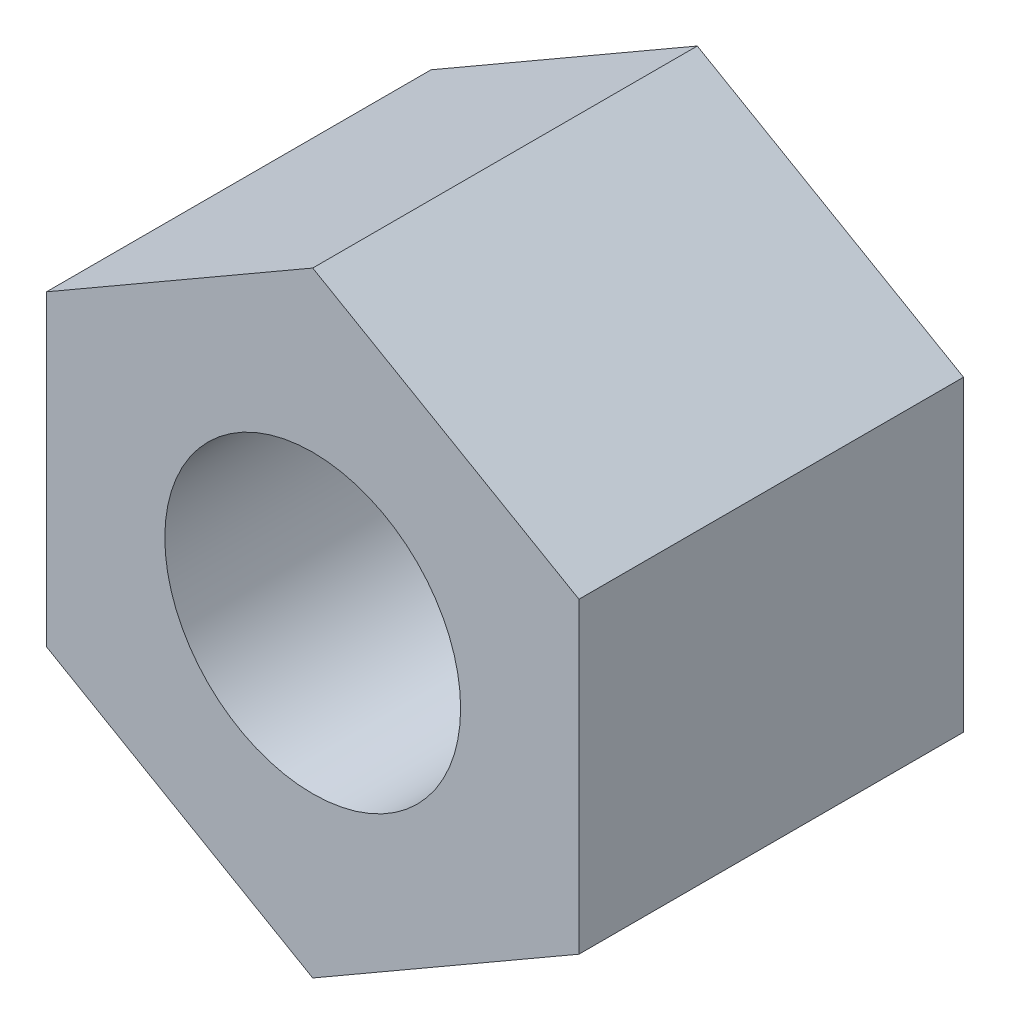
ISO-10303-21;
HEADER;
FILE_DESCRIPTION(('STEP AP214'),'2;1');
FILE_NAME('part.step','',(''),(''),'','','');
FILE_SCHEMA(('AUTOMOTIVE_DESIGN { 1 0 10303 214 1 1 1 1 }'));
ENDSEC;
DATA;
#1=APPLICATION_CONTEXT('core data for automotive mechanical design processes');
#2=APPLICATION_PROTOCOL_DEFINITION('international standard','automotive_design',2000,#1);
#3=PRODUCT_CONTEXT('',#1,'mechanical');
#4=PRODUCT('Part','Part','',(#3));
#5=PRODUCT_RELATED_PRODUCT_CATEGORY('part','',(#4));
#6=PRODUCT_DEFINITION_FORMATION('','',#4);
#7=PRODUCT_DEFINITION_CONTEXT('part definition',#1,'design');
#8=PRODUCT_DEFINITION('design','',#6,#7);
#9=PRODUCT_DEFINITION_SHAPE('','',#8);
#10=(LENGTH_UNIT() NAMED_UNIT(*) SI_UNIT(.MILLI.,.METRE.));
#11=(NAMED_UNIT(*) PLANE_ANGLE_UNIT() SI_UNIT($,.RADIAN.));
#12=(NAMED_UNIT(*) SI_UNIT($,.STERADIAN.) SOLID_ANGLE_UNIT());
#13=UNCERTAINTY_MEASURE_WITH_UNIT(LENGTH_MEASURE(1.E-05),#10,'distance_accuracy_value','');
#14=(GEOMETRIC_REPRESENTATION_CONTEXT(3) GLOBAL_UNCERTAINTY_ASSIGNED_CONTEXT((#13)) GLOBAL_UNIT_ASSIGNED_CONTEXT((#10,
#11,#12)) REPRESENTATION_CONTEXT('',''));
#15=CARTESIAN_POINT('',(0.,0.,0.));
#16=DIRECTION('',(0.,0.,1.));
#17=DIRECTION('',(1.,0.,0.));
#18=AXIS2_PLACEMENT_3D('',#15,#16,#17);
#19=CARTESIAN_POINT('',(0.,0.,3.9));
#20=DIRECTION('',(0.,0.,1.));
#21=DIRECTION('',(1.,0.,0.));
#22=AXIS2_PLACEMENT_3D('',#19,#20,#21);
#23=PLANE('',#22);
#24=DIRECTION('',(-0.866025403784439,0.5,0.));
#25=VECTOR('',#24,1.);
#26=CARTESIAN_POINT('',(2.7,1.55884572681199,3.9));
#27=LINE('',#26,#25);
#28=CARTESIAN_POINT('',(2.7,1.55884572681199,3.9));
#29=VERTEX_POINT('',#28);
#30=CARTESIAN_POINT('',(0.,3.11769145362398,3.9));
#31=VERTEX_POINT('',#30);
#32=EDGE_CURVE('E146',#29,#31,#27,.T.);
#33=ORIENTED_EDGE('',*,*,#32,.T.);
#34=DIRECTION('',(-0.866025403784439,-0.5,0.));
#35=VECTOR('',#34,1.);
#36=CARTESIAN_POINT('',(0.,3.11769145362398,3.9));
#37=LINE('',#36,#35);
#38=CARTESIAN_POINT('',(-2.7,1.55884572681199,3.9));
#39=VERTEX_POINT('',#38);
#40=EDGE_CURVE('E94',#31,#39,#37,.T.);
#41=ORIENTED_EDGE('',*,*,#40,.T.);
#42=DIRECTION('',(0.,-1.,0.));
#43=VECTOR('',#42,1.);
#44=CARTESIAN_POINT('',(-2.7,1.55884572681199,3.9));
#45=LINE('',#44,#43);
#46=CARTESIAN_POINT('',(-2.7,-1.55884572681199,3.9));
#47=VERTEX_POINT('',#46);
#48=EDGE_CURVE('E107',#39,#47,#45,.T.);
#49=ORIENTED_EDGE('',*,*,#48,.T.);
#50=DIRECTION('',(0.866025403784438,-0.5,0.));
#51=VECTOR('',#50,1.);
#52=CARTESIAN_POINT('',(-2.7,-1.55884572681199,3.9));
#53=LINE('',#52,#51);
#54=CARTESIAN_POINT('',(0.,-3.11769145362398,3.9));
#55=VERTEX_POINT('',#54);
#56=EDGE_CURVE('E101',#47,#55,#53,.T.);
#57=ORIENTED_EDGE('',*,*,#56,.T.);
#58=DIRECTION('',(0.866025403784439,0.5,0.));
#59=VECTOR('',#58,1.);
#60=CARTESIAN_POINT('',(0.,-3.11769145362398,3.9));
#61=LINE('',#60,#59);
#62=CARTESIAN_POINT('',(2.7,-1.55884572681199,3.9));
#63=VERTEX_POINT('',#62);
#64=EDGE_CURVE('E105',#55,#63,#61,.T.);
#65=ORIENTED_EDGE('',*,*,#64,.T.);
#66=DIRECTION('',(0.,1.,0.));
#67=VECTOR('',#66,1.);
#68=CARTESIAN_POINT('',(2.7,-1.55884572681199,3.9));
#69=LINE('',#68,#67);
#70=EDGE_CURVE('E57',#63,#29,#69,.T.);
#71=ORIENTED_EDGE('',*,*,#70,.T.);
#72=EDGE_LOOP('',(#33,#41,#49,#57,#65,#71));
#73=FACE_BOUND('',#72,.T.);
#74=CARTESIAN_POINT('',(0.,0.,3.9));
#75=DIRECTION('',(0.,0.,1.));
#76=DIRECTION('',(1.,0.,0.));
#77=AXIS2_PLACEMENT_3D('',#74,#75,#76);
#78=CIRCLE('',#77,1.5);
#79=CARTESIAN_POINT('',(1.5,0.,3.9));
#80=VERTEX_POINT('',#79);
#81=EDGE_CURVE('E134',#80,#80,#78,.T.);
#82=ORIENTED_EDGE('',*,*,#81,.F.);
#83=EDGE_LOOP('',(#82));
#84=FACE_BOUND('',#83,.T.);
#85=ADVANCED_FACE('F39',(#73,#84),#23,.T.);
#86=CARTESIAN_POINT('',(0.,0.,0.));
#87=DIRECTION('',(0.,0.,1.));
#88=DIRECTION('',(1.,0.,0.));
#89=AXIS2_PLACEMENT_3D('',#86,#87,#88);
#90=PLANE('',#89);
#91=DIRECTION('',(-0.866025403784439,0.5,0.));
#92=VECTOR('',#91,1.);
#93=CARTESIAN_POINT('',(2.7,1.55884572681199,0.));
#94=LINE('',#93,#92);
#95=CARTESIAN_POINT('',(2.7,1.55884572681199,0.));
#96=VERTEX_POINT('',#95);
#97=CARTESIAN_POINT('',(0.,3.11769145362398,0.));
#98=VERTEX_POINT('',#97);
#99=EDGE_CURVE('E129',#96,#98,#94,.T.);
#100=ORIENTED_EDGE('',*,*,#99,.F.);
#101=DIRECTION('',(0.,1.,0.));
#102=VECTOR('',#101,1.);
#103=CARTESIAN_POINT('',(2.7,-1.55884572681199,0.));
#104=LINE('',#103,#102);
#105=CARTESIAN_POINT('',(2.7,-1.55884572681199,0.));
#106=VERTEX_POINT('',#105);
#107=EDGE_CURVE('E86',#106,#96,#104,.T.);
#108=ORIENTED_EDGE('',*,*,#107,.F.);
#109=DIRECTION('',(0.866025403784439,0.5,0.));
#110=VECTOR('',#109,1.);
#111=CARTESIAN_POINT('',(0.,-3.11769145362398,0.));
#112=LINE('',#111,#110);
#113=CARTESIAN_POINT('',(0.,-3.11769145362398,0.));
#114=VERTEX_POINT('',#113);
#115=EDGE_CURVE('E80',#114,#106,#112,.T.);
#116=ORIENTED_EDGE('',*,*,#115,.F.);
#117=DIRECTION('',(0.866025403784438,-0.5,0.));
#118=VECTOR('',#117,1.);
#119=CARTESIAN_POINT('',(-2.7,-1.55884572681199,0.));
#120=LINE('',#119,#118);
#121=CARTESIAN_POINT('',(-2.7,-1.55884572681199,0.));
#122=VERTEX_POINT('',#121);
#123=EDGE_CURVE('E116',#122,#114,#120,.T.);
#124=ORIENTED_EDGE('',*,*,#123,.F.);
#125=DIRECTION('',(0.,-1.,0.));
#126=VECTOR('',#125,1.);
#127=CARTESIAN_POINT('',(-2.7,1.55884572681199,0.));
#128=LINE('',#127,#126);
#129=CARTESIAN_POINT('',(-2.7,1.55884572681199,0.));
#130=VERTEX_POINT('',#129);
#131=EDGE_CURVE('E137',#130,#122,#128,.T.);
#132=ORIENTED_EDGE('',*,*,#131,.F.);
#133=DIRECTION('',(-0.866025403784439,-0.5,0.));
#134=VECTOR('',#133,1.);
#135=CARTESIAN_POINT('',(0.,3.11769145362398,0.));
#136=LINE('',#135,#134);
#137=EDGE_CURVE('E133',#98,#130,#136,.T.);
#138=ORIENTED_EDGE('',*,*,#137,.F.);
#139=EDGE_LOOP('',(#100,#108,#116,#124,#132,#138));
#140=FACE_BOUND('',#139,.T.);
#141=CARTESIAN_POINT('',(0.,0.,0.));
#142=DIRECTION('',(0.,0.,1.));
#143=DIRECTION('',(1.,0.,0.));
#144=AXIS2_PLACEMENT_3D('',#141,#142,#143);
#145=CIRCLE('',#144,1.5);
#146=CARTESIAN_POINT('',(1.5,0.,0.));
#147=VERTEX_POINT('',#146);
#148=EDGE_CURVE('E243',#147,#147,#145,.T.);
#149=ORIENTED_EDGE('',*,*,#148,.T.);
#150=EDGE_LOOP('',(#149));
#151=FACE_BOUND('',#150,.T.);
#152=ADVANCED_FACE('F159',(#140,#151),#90,.F.);
#153=CARTESIAN_POINT('',(2.7,1.55884572681199,3.9));
#154=DIRECTION('',(-0.5,-0.866025403784439,0.));
#155=DIRECTION('',(0.866025403784439,-0.5,0.));
#156=AXIS2_PLACEMENT_3D('',#153,#154,#155);
#157=PLANE('',#156);
#158=ORIENTED_EDGE('',*,*,#99,.T.);
#159=DIRECTION('',(0.,0.,-1.));
#160=VECTOR('',#159,1.);
#161=CARTESIAN_POINT('',(0.,3.11769145362398,3.9));
#162=LINE('',#161,#160);
#163=EDGE_CURVE('E11',#31,#98,#162,.T.);
#164=ORIENTED_EDGE('',*,*,#163,.F.);
#165=ORIENTED_EDGE('',*,*,#32,.F.);
#166=DIRECTION('',(0.,0.,-1.));
#167=VECTOR('',#166,1.);
#168=CARTESIAN_POINT('',(2.7,1.55884572681199,3.9));
#169=LINE('',#168,#167);
#170=EDGE_CURVE('E125',#29,#96,#169,.T.);
#171=ORIENTED_EDGE('',*,*,#170,.T.);
#172=EDGE_LOOP('',(#158,#164,#165,#171));
#173=FACE_BOUND('',#172,.T.);
#174=ADVANCED_FACE('F41',(#173),#157,.F.);
#175=CARTESIAN_POINT('',(0.,3.11769145362398,3.9));
#176=DIRECTION('',(0.5,-0.866025403784438,0.));
#177=DIRECTION('',(0.866025403784438,0.5,0.));
#178=AXIS2_PLACEMENT_3D('',#175,#176,#177);
#179=PLANE('',#178);
#180=ORIENTED_EDGE('',*,*,#137,.T.);
#181=DIRECTION('',(0.,0.,-1.));
#182=VECTOR('',#181,1.);
#183=CARTESIAN_POINT('',(-2.7,1.55884572681199,3.9));
#184=LINE('',#183,#182);
#185=EDGE_CURVE('E49',#39,#130,#184,.T.);
#186=ORIENTED_EDGE('',*,*,#185,.F.);
#187=ORIENTED_EDGE('',*,*,#40,.F.);
#188=ORIENTED_EDGE('',*,*,#163,.T.);
#189=EDGE_LOOP('',(#180,#186,#187,#188));
#190=FACE_BOUND('',#189,.T.);
#191=ADVANCED_FACE('F184',(#190),#179,.F.);
#192=CARTESIAN_POINT('',(-2.7,1.55884572681199,3.9));
#193=DIRECTION('',(1.,0.,0.));
#194=DIRECTION('',(0.,0.,-1.));
#195=AXIS2_PLACEMENT_3D('',#192,#193,#194);
#196=PLANE('',#195);
#197=ORIENTED_EDGE('',*,*,#131,.T.);
#198=DIRECTION('',(0.,0.,-1.));
#199=VECTOR('',#198,1.);
#200=CARTESIAN_POINT('',(-2.7,-1.55884572681199,3.9));
#201=LINE('',#200,#199);
#202=EDGE_CURVE('E118',#47,#122,#201,.T.);
#203=ORIENTED_EDGE('',*,*,#202,.F.);
#204=ORIENTED_EDGE('',*,*,#48,.F.);
#205=ORIENTED_EDGE('',*,*,#185,.T.);
#206=EDGE_LOOP('',(#197,#203,#204,#205));
#207=FACE_BOUND('',#206,.T.);
#208=ADVANCED_FACE('F156',(#207),#196,.F.);
#209=CARTESIAN_POINT('',(-2.7,-1.55884572681199,3.9));
#210=DIRECTION('',(0.5,0.866025403784439,0.));
#211=DIRECTION('',(-0.866025403784439,0.5,0.));
#212=AXIS2_PLACEMENT_3D('',#209,#210,#211);
#213=PLANE('',#212);
#214=ORIENTED_EDGE('',*,*,#123,.T.);
#215=DIRECTION('',(0.,0.,-1.));
#216=VECTOR('',#215,1.);
#217=CARTESIAN_POINT('',(0.,-3.11769145362398,3.9));
#218=LINE('',#217,#216);
#219=EDGE_CURVE('E113',#55,#114,#218,.T.);
#220=ORIENTED_EDGE('',*,*,#219,.F.);
#221=ORIENTED_EDGE('',*,*,#56,.F.);
#222=ORIENTED_EDGE('',*,*,#202,.T.);
#223=EDGE_LOOP('',(#214,#220,#221,#222));
#224=FACE_BOUND('',#223,.T.);
#225=ADVANCED_FACE('F114',(#224),#213,.F.);
#226=CARTESIAN_POINT('',(0.,-3.11769145362398,3.9));
#227=DIRECTION('',(-0.5,0.866025403784439,0.));
#228=DIRECTION('',(-0.866025403784439,-0.5,0.));
#229=AXIS2_PLACEMENT_3D('',#226,#227,#228);
#230=PLANE('',#229);
#231=ORIENTED_EDGE('',*,*,#115,.T.);
#232=DIRECTION('',(0.,0.,-1.));
#233=VECTOR('',#232,1.);
#234=CARTESIAN_POINT('',(2.7,-1.55884572681199,3.9));
#235=LINE('',#234,#233);
#236=EDGE_CURVE('E119',#63,#106,#235,.T.);
#237=ORIENTED_EDGE('',*,*,#236,.F.);
#238=ORIENTED_EDGE('',*,*,#64,.F.);
#239=ORIENTED_EDGE('',*,*,#219,.T.);
#240=EDGE_LOOP('',(#231,#237,#238,#239));
#241=FACE_BOUND('',#240,.T.);
#242=ADVANCED_FACE('F121',(#241),#230,.F.);
#243=CARTESIAN_POINT('',(2.7,-1.55884572681199,3.9));
#244=DIRECTION('',(-1.,0.,0.));
#245=DIRECTION('',(0.,-1.,0.));
#246=AXIS2_PLACEMENT_3D('',#243,#244,#245);
#247=PLANE('',#246);
#248=ORIENTED_EDGE('',*,*,#107,.T.);
#249=ORIENTED_EDGE('',*,*,#170,.F.);
#250=ORIENTED_EDGE('',*,*,#70,.F.);
#251=ORIENTED_EDGE('',*,*,#236,.T.);
#252=EDGE_LOOP('',(#248,#249,#250,#251));
#253=FACE_BOUND('',#252,.T.);
#254=ADVANCED_FACE('F164',(#253),#247,.F.);
#255=CARTESIAN_POINT('',(0.,0.,3.9));
#256=DIRECTION('',(0.,0.,-1.));
#257=DIRECTION('',(-1.,0.,0.));
#258=AXIS2_PLACEMENT_3D('',#255,#256,#257);
#259=CYLINDRICAL_SURFACE('',#258,1.5);
#260=ORIENTED_EDGE('',*,*,#81,.T.);
#261=EDGE_LOOP('',(#260));
#262=FACE_BOUND('',#261,.T.);
#263=ORIENTED_EDGE('',*,*,#148,.F.);
#264=EDGE_LOOP('',(#263));
#265=FACE_BOUND('',#264,.T.);
#266=ADVANCED_FACE('F166',(#262,#265),#259,.F.);
#267=CLOSED_SHELL('',(#85,#152,#174,#191,#208,#225,#242,#254,#266));
#268=MANIFOLD_SOLID_BREP('B2',#267);
#269=ADVANCED_BREP_SHAPE_REPRESENTATION('',(#18,#268),#14);
#270=SHAPE_DEFINITION_REPRESENTATION(#9,#269);
ENDSEC;
END-ISO-10303-21;
